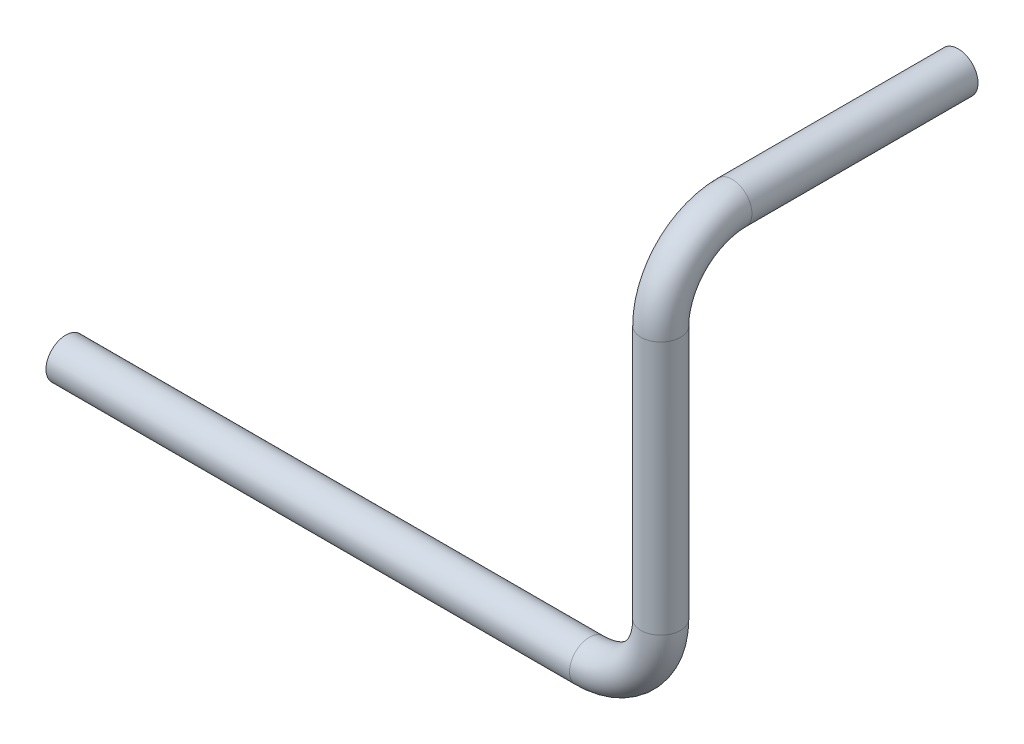
ISO-10303-21;
HEADER;
FILE_DESCRIPTION(('STEP AP214'),'2;1');
FILE_NAME('part.step','',(''),(''),'','','');
FILE_SCHEMA(('AUTOMOTIVE_DESIGN { 1 0 10303 214 1 1 1 1 }'));
ENDSEC;
DATA;
#1=APPLICATION_CONTEXT('core data for automotive mechanical design processes');
#2=APPLICATION_PROTOCOL_DEFINITION('international standard','automotive_design',2000,#1);
#3=PRODUCT_CONTEXT('',#1,'mechanical');
#4=PRODUCT('Part','Part','',(#3));
#5=PRODUCT_RELATED_PRODUCT_CATEGORY('part','',(#4));
#6=PRODUCT_DEFINITION_FORMATION('','',#4);
#7=PRODUCT_DEFINITION_CONTEXT('part definition',#1,'design');
#8=PRODUCT_DEFINITION('design','',#6,#7);
#9=PRODUCT_DEFINITION_SHAPE('','',#8);
#10=(LENGTH_UNIT() NAMED_UNIT(*) SI_UNIT(.MILLI.,.METRE.));
#11=(NAMED_UNIT(*) PLANE_ANGLE_UNIT() SI_UNIT($,.RADIAN.));
#12=(NAMED_UNIT(*) SI_UNIT($,.STERADIAN.) SOLID_ANGLE_UNIT());
#13=UNCERTAINTY_MEASURE_WITH_UNIT(LENGTH_MEASURE(1.E-05),#10,'distance_accuracy_value','');
#14=(GEOMETRIC_REPRESENTATION_CONTEXT(3) GLOBAL_UNCERTAINTY_ASSIGNED_CONTEXT((#13)) GLOBAL_UNIT_ASSIGNED_CONTEXT((#10,
#11,#12)) REPRESENTATION_CONTEXT('',''));
#15=CARTESIAN_POINT('',(0.,0.,0.));
#16=DIRECTION('',(0.,0.,1.));
#17=DIRECTION('',(1.,0.,0.));
#18=AXIS2_PLACEMENT_3D('',#15,#16,#17);
#19=CARTESIAN_POINT('',(0.,0.,0.));
#20=DIRECTION('',(1.,0.,0.));
#21=DIRECTION('',(0.,0.,-1.));
#22=AXIS2_PLACEMENT_3D('',#19,#20,#21);
#23=PLANE('',#22);
#24=CARTESIAN_POINT('',(0.,0.,0.));
#25=DIRECTION('',(1.,0.,0.));
#26=DIRECTION('',(0.,0.,-1.));
#27=AXIS2_PLACEMENT_3D('',#24,#25,#26);
#28=CIRCLE('',#27,9.);
#29=CARTESIAN_POINT('',(0.,0.,-9.));
#30=VERTEX_POINT('',#29);
#31=EDGE_CURVE('E178',#30,#30,#28,.T.);
#32=ORIENTED_EDGE('',*,*,#31,.T.);
#33=EDGE_LOOP('',(#32));
#34=FACE_BOUND('',#33,.T.);
#35=CARTESIAN_POINT('',(0.,0.,0.));
#36=DIRECTION('',(1.,0.,0.));
#37=DIRECTION('',(0.,0.,-1.));
#38=AXIS2_PLACEMENT_3D('',#35,#36,#37);
#39=CIRCLE('',#38,10.);
#40=CARTESIAN_POINT('',(0.,0.,-10.));
#41=VERTEX_POINT('',#40);
#42=EDGE_CURVE('E59',#41,#41,#39,.T.);
#43=ORIENTED_EDGE('',*,*,#42,.F.);
#44=EDGE_LOOP('',(#43));
#45=FACE_BOUND('',#44,.T.);
#46=ADVANCED_FACE('F37',(#34,#45),#23,.F.);
#47=CARTESIAN_POINT('',(300.,200.,-150.));
#48=DIRECTION('',(0.,0.,-1.));
#49=DIRECTION('',(0.,-1.,0.));
#50=AXIS2_PLACEMENT_3D('',#47,#48,#49);
#51=PLANE('',#50);
#52=CARTESIAN_POINT('',(300.,200.,-150.));
#53=DIRECTION('',(0.,0.,-1.));
#54=DIRECTION('',(0.,-1.,0.));
#55=AXIS2_PLACEMENT_3D('',#52,#53,#54);
#56=CIRCLE('',#55,9.);
#57=CARTESIAN_POINT('',(300.,191.,-150.));
#58=VERTEX_POINT('',#57);
#59=EDGE_CURVE('E63',#58,#58,#56,.T.);
#60=ORIENTED_EDGE('',*,*,#59,.F.);
#61=EDGE_LOOP('',(#60));
#62=FACE_BOUND('',#61,.T.);
#63=CARTESIAN_POINT('',(300.,200.,-150.));
#64=DIRECTION('',(0.,0.,-1.));
#65=DIRECTION('',(-1.,0.,0.));
#66=AXIS2_PLACEMENT_3D('',#63,#64,#65);
#67=CIRCLE('',#66,10.);
#68=CARTESIAN_POINT('',(290.,200.,-150.));
#69=VERTEX_POINT('',#68);
#70=EDGE_CURVE('E10',#69,#69,#67,.T.);
#71=ORIENTED_EDGE('',*,*,#70,.T.);
#72=EDGE_LOOP('',(#71));
#73=FACE_BOUND('',#72,.T.);
#74=ADVANCED_FACE('F94',(#62,#73),#51,.T.);
#75=CARTESIAN_POINT('',(0.,0.,0.));
#76=DIRECTION('',(1.,0.,0.));
#77=DIRECTION('',(0.,0.,-1.));
#78=AXIS2_PLACEMENT_3D('',#75,#76,#77);
#79=CYLINDRICAL_SURFACE('',#78,10.);
#80=CARTESIAN_POINT('',(264.,0.,0.));
#81=DIRECTION('',(-1.,0.,0.));
#82=DIRECTION('',(0.,-1.,0.));
#83=AXIS2_PLACEMENT_3D('',#80,#81,#82);
#84=CIRCLE('',#83,10.);
#85=CARTESIAN_POINT('',(264.,-9.99999999999999,0.));
#86=VERTEX_POINT('',#85);
#87=EDGE_CURVE('E62',#86,#86,#84,.F.);
#88=ORIENTED_EDGE('',*,*,#87,.F.);
#89=EDGE_LOOP('',(#88));
#90=FACE_BOUND('',#89,.T.);
#91=ORIENTED_EDGE('',*,*,#42,.T.);
#92=EDGE_LOOP('',(#91));
#93=FACE_BOUND('',#92,.T.);
#94=ADVANCED_FACE('F89',(#90,#93),#79,.T.);
#95=CARTESIAN_POINT('',(264.,36.,0.));
#96=DIRECTION('',(0.,0.,1.));
#97=DIRECTION('',(1.,0.,0.));
#98=AXIS2_PLACEMENT_3D('',#95,#96,#97);
#99=TOROIDAL_SURFACE('',#98,36.,10.);
#100=CARTESIAN_POINT('',(300.,36.,0.));
#101=DIRECTION('',(0.,1.,0.));
#102=DIRECTION('',(0.,0.,1.));
#103=AXIS2_PLACEMENT_3D('',#100,#101,#102);
#104=CIRCLE('',#103,10.);
#105=CARTESIAN_POINT('',(310.,36.,0.));
#106=VERTEX_POINT('',#105);
#107=EDGE_CURVE('E56',#106,#106,#104,.T.);
#108=CARTESIAN_POINT('',(264.,36.,0.));
#109=DIRECTION('',(0.,0.,1.));
#110=DIRECTION('',(1.,0.,0.));
#111=AXIS2_PLACEMENT_3D('',#108,#109,#110);
#112=CIRCLE('',#111,46.);
#113=EDGE_CURVE('',#86,#106,#112,.T.);
#114=ORIENTED_EDGE('',*,*,#87,.T.);
#115=ORIENTED_EDGE('',*,*,#107,.F.);
#116=ORIENTED_EDGE('',*,*,#113,.T.);
#117=ORIENTED_EDGE('',*,*,#113,.F.);
#118=EDGE_LOOP('',(#114,#116,#115,#117));
#119=FACE_BOUND('',#118,.T.);
#120=ADVANCED_FACE('F86',(#119),#99,.T.);
#121=CARTESIAN_POINT('',(300.,36.,0.));
#122=DIRECTION('',(0.,1.,0.));
#123=DIRECTION('',(0.,0.,1.));
#124=AXIS2_PLACEMENT_3D('',#121,#122,#123);
#125=CYLINDRICAL_SURFACE('',#124,10.);
#126=CARTESIAN_POINT('',(300.,164.,0.));
#127=DIRECTION('',(0.,-1.,0.));
#128=DIRECTION('',(0.,0.,-1.));
#129=AXIS2_PLACEMENT_3D('',#126,#127,#128);
#130=CIRCLE('',#129,10.);
#131=CARTESIAN_POINT('',(300.,164.,10.));
#132=VERTEX_POINT('',#131);
#133=EDGE_CURVE('E50',#132,#132,#130,.F.);
#134=ORIENTED_EDGE('',*,*,#133,.F.);
#135=EDGE_LOOP('',(#134));
#136=FACE_BOUND('',#135,.T.);
#137=ORIENTED_EDGE('',*,*,#107,.T.);
#138=EDGE_LOOP('',(#137));
#139=FACE_BOUND('',#138,.T.);
#140=ADVANCED_FACE('F84',(#136,#139),#125,.T.);
#141=CARTESIAN_POINT('',(300.,164.,-36.));
#142=DIRECTION('',(-1.,0.,0.));
#143=DIRECTION('',(0.,0.,1.));
#144=AXIS2_PLACEMENT_3D('',#141,#142,#143);
#145=TOROIDAL_SURFACE('',#144,36.,10.);
#146=CARTESIAN_POINT('',(300.,200.,-36.));
#147=DIRECTION('',(0.,0.,-1.));
#148=DIRECTION('',(-1.,0.,0.));
#149=AXIS2_PLACEMENT_3D('',#146,#147,#148);
#150=CIRCLE('',#149,10.);
#151=CARTESIAN_POINT('',(300.,210.,-36.));
#152=VERTEX_POINT('',#151);
#153=EDGE_CURVE('E45',#152,#152,#150,.T.);
#154=CARTESIAN_POINT('',(300.,164.,-36.));
#155=DIRECTION('',(-1.,0.,0.));
#156=DIRECTION('',(0.,0.,1.));
#157=AXIS2_PLACEMENT_3D('',#154,#155,#156);
#158=CIRCLE('',#157,46.);
#159=EDGE_CURVE('',#132,#152,#158,.T.);
#160=ORIENTED_EDGE('',*,*,#133,.T.);
#161=ORIENTED_EDGE('',*,*,#153,.F.);
#162=ORIENTED_EDGE('',*,*,#159,.T.);
#163=ORIENTED_EDGE('',*,*,#159,.F.);
#164=EDGE_LOOP('',(#160,#162,#161,#163));
#165=FACE_BOUND('',#164,.T.);
#166=ADVANCED_FACE('F104',(#165),#145,.T.);
#167=CARTESIAN_POINT('',(300.,200.,-36.));
#168=DIRECTION('',(0.,0.,-1.));
#169=DIRECTION('',(-1.,0.,0.));
#170=AXIS2_PLACEMENT_3D('',#167,#168,#169);
#171=CYLINDRICAL_SURFACE('',#170,10.);
#172=ORIENTED_EDGE('',*,*,#70,.F.);
#173=EDGE_LOOP('',(#172));
#174=FACE_BOUND('',#173,.T.);
#175=ORIENTED_EDGE('',*,*,#153,.T.);
#176=EDGE_LOOP('',(#175));
#177=FACE_BOUND('',#176,.T.);
#178=ADVANCED_FACE('F39',(#174,#177),#171,.T.);
#179=CARTESIAN_POINT('',(0.,0.,0.));
#180=DIRECTION('',(1.,0.,0.));
#181=DIRECTION('',(0.,0.,-1.));
#182=AXIS2_PLACEMENT_3D('',#179,#180,#181);
#183=CYLINDRICAL_SURFACE('',#182,9.);
#184=CARTESIAN_POINT('',(264.,0.,0.));
#185=DIRECTION('',(1.,0.,0.));
#186=DIRECTION('',(0.,0.,-1.));
#187=AXIS2_PLACEMENT_3D('',#184,#185,#186);
#188=CIRCLE('',#187,9.);
#189=CARTESIAN_POINT('',(264.,-8.99999999999999,0.));
#190=VERTEX_POINT('',#189);
#191=EDGE_CURVE('E176',#190,#190,#188,.T.);
#192=ORIENTED_EDGE('',*,*,#191,.T.);
#193=EDGE_LOOP('',(#192));
#194=FACE_BOUND('',#193,.T.);
#195=ORIENTED_EDGE('',*,*,#31,.F.);
#196=EDGE_LOOP('',(#195));
#197=FACE_BOUND('',#196,.T.);
#198=ADVANCED_FACE('F103',(#194,#197),#183,.F.);
#199=CARTESIAN_POINT('',(264.,36.,0.));
#200=DIRECTION('',(0.,0.,1.));
#201=DIRECTION('',(1.,0.,0.));
#202=AXIS2_PLACEMENT_3D('',#199,#200,#201);
#203=TOROIDAL_SURFACE('',#202,36.,9.);
#204=CARTESIAN_POINT('',(300.,36.,0.));
#205=DIRECTION('',(0.,1.,0.));
#206=DIRECTION('',(0.,0.,-1.));
#207=AXIS2_PLACEMENT_3D('',#204,#205,#206);
#208=CIRCLE('',#207,9.);
#209=CARTESIAN_POINT('',(309.,36.,0.));
#210=VERTEX_POINT('',#209);
#211=EDGE_CURVE('E173',#210,#210,#208,.T.);
#212=CARTESIAN_POINT('',(264.,36.,0.));
#213=DIRECTION('',(0.,0.,1.));
#214=DIRECTION('',(1.,0.,0.));
#215=AXIS2_PLACEMENT_3D('',#212,#213,#214);
#216=CIRCLE('',#215,45.);
#217=EDGE_CURVE('',#190,#210,#216,.T.);
#218=ORIENTED_EDGE('',*,*,#191,.F.);
#219=ORIENTED_EDGE('',*,*,#211,.T.);
#220=ORIENTED_EDGE('',*,*,#217,.T.);
#221=ORIENTED_EDGE('',*,*,#217,.F.);
#222=EDGE_LOOP('',(#218,#220,#219,#221));
#223=FACE_BOUND('',#222,.T.);
#224=ADVANCED_FACE('F110',(#223),#203,.F.);
#225=CARTESIAN_POINT('',(300.,36.,0.));
#226=DIRECTION('',(0.,1.,0.));
#227=DIRECTION('',(0.,0.,1.));
#228=AXIS2_PLACEMENT_3D('',#225,#226,#227);
#229=CYLINDRICAL_SURFACE('',#228,9.);
#230=CARTESIAN_POINT('',(300.,164.,0.));
#231=DIRECTION('',(0.,1.,0.));
#232=DIRECTION('',(0.,0.,-1.));
#233=AXIS2_PLACEMENT_3D('',#230,#231,#232);
#234=CIRCLE('',#233,9.);
#235=CARTESIAN_POINT('',(300.,164.,9.00000000000001));
#236=VERTEX_POINT('',#235);
#237=EDGE_CURVE('E77',#236,#236,#234,.T.);
#238=ORIENTED_EDGE('',*,*,#237,.T.);
#239=EDGE_LOOP('',(#238));
#240=FACE_BOUND('',#239,.T.);
#241=ORIENTED_EDGE('',*,*,#211,.F.);
#242=EDGE_LOOP('',(#241));
#243=FACE_BOUND('',#242,.T.);
#244=ADVANCED_FACE('F158',(#240,#243),#229,.F.);
#245=CARTESIAN_POINT('',(300.,164.,-36.));
#246=DIRECTION('',(-1.,0.,0.));
#247=DIRECTION('',(0.,0.,1.));
#248=AXIS2_PLACEMENT_3D('',#245,#246,#247);
#249=TOROIDAL_SURFACE('',#248,36.,9.);
#250=CARTESIAN_POINT('',(300.,200.,-36.));
#251=DIRECTION('',(0.,0.,-1.));
#252=DIRECTION('',(0.,-1.,0.));
#253=AXIS2_PLACEMENT_3D('',#250,#251,#252);
#254=CIRCLE('',#253,9.);
#255=CARTESIAN_POINT('',(300.,209.,-36.));
#256=VERTEX_POINT('',#255);
#257=EDGE_CURVE('E71',#256,#256,#254,.T.);
#258=CARTESIAN_POINT('',(300.,164.,-36.));
#259=DIRECTION('',(-1.,0.,0.));
#260=DIRECTION('',(0.,0.,1.));
#261=AXIS2_PLACEMENT_3D('',#258,#259,#260);
#262=CIRCLE('',#261,45.);
#263=EDGE_CURVE('',#236,#256,#262,.T.);
#264=ORIENTED_EDGE('',*,*,#237,.F.);
#265=ORIENTED_EDGE('',*,*,#257,.T.);
#266=ORIENTED_EDGE('',*,*,#263,.T.);
#267=ORIENTED_EDGE('',*,*,#263,.F.);
#268=EDGE_LOOP('',(#264,#266,#265,#267));
#269=FACE_BOUND('',#268,.T.);
#270=ADVANCED_FACE('F153',(#269),#249,.F.);
#271=CARTESIAN_POINT('',(300.,200.,-36.));
#272=DIRECTION('',(0.,0.,-1.));
#273=DIRECTION('',(-1.,0.,0.));
#274=AXIS2_PLACEMENT_3D('',#271,#272,#273);
#275=CYLINDRICAL_SURFACE('',#274,9.);
#276=ORIENTED_EDGE('',*,*,#59,.T.);
#277=EDGE_LOOP('',(#276));
#278=FACE_BOUND('',#277,.T.);
#279=ORIENTED_EDGE('',*,*,#257,.F.);
#280=EDGE_LOOP('',(#279));
#281=FACE_BOUND('',#280,.T.);
#282=ADVANCED_FACE('F146',(#278,#281),#275,.F.);
#283=CLOSED_SHELL('',(#46,#74,#94,#120,#140,#166,#178,#198,#224,#244,#270,#282));
#284=MANIFOLD_SOLID_BREP('B2',#283);
#285=ADVANCED_BREP_SHAPE_REPRESENTATION('',(#18,#284),#14);
#286=SHAPE_DEFINITION_REPRESENTATION(#9,#285);
ENDSEC;
END-ISO-10303-21;
